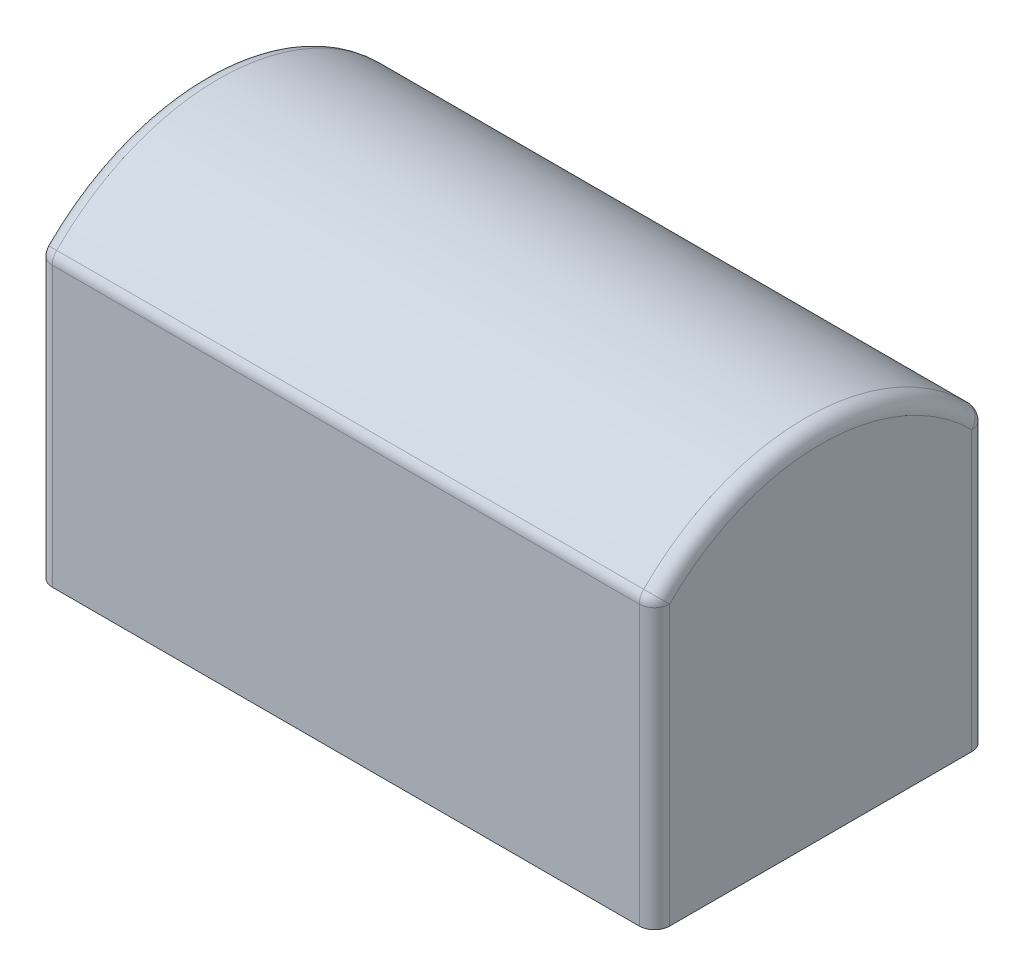
ISO-10303-21;
HEADER;
FILE_DESCRIPTION(('STEP AP214'),'2;1');
FILE_NAME('part.step','',(''),(''),'','','');
FILE_SCHEMA(('AUTOMOTIVE_DESIGN { 1 0 10303 214 1 1 1 1 }'));
ENDSEC;
DATA;
#1=APPLICATION_CONTEXT('core data for automotive mechanical design processes');
#2=APPLICATION_PROTOCOL_DEFINITION('international standard','automotive_design',2000,#1);
#3=PRODUCT_CONTEXT('',#1,'mechanical');
#4=PRODUCT('Part','Part','',(#3));
#5=PRODUCT_RELATED_PRODUCT_CATEGORY('part','',(#4));
#6=PRODUCT_DEFINITION_FORMATION('','',#4);
#7=PRODUCT_DEFINITION_CONTEXT('part definition',#1,'design');
#8=PRODUCT_DEFINITION('design','',#6,#7);
#9=PRODUCT_DEFINITION_SHAPE('','',#8);
#10=(LENGTH_UNIT() NAMED_UNIT(*) SI_UNIT(.MILLI.,.METRE.));
#11=(NAMED_UNIT(*) PLANE_ANGLE_UNIT() SI_UNIT($,.RADIAN.));
#12=(NAMED_UNIT(*) SI_UNIT($,.STERADIAN.) SOLID_ANGLE_UNIT());
#13=UNCERTAINTY_MEASURE_WITH_UNIT(LENGTH_MEASURE(1.E-05),#10,'distance_accuracy_value','');
#14=(GEOMETRIC_REPRESENTATION_CONTEXT(3) GLOBAL_UNCERTAINTY_ASSIGNED_CONTEXT((#13)) GLOBAL_UNIT_ASSIGNED_CONTEXT((#10,
#11,#12)) REPRESENTATION_CONTEXT('',''));
#15=CARTESIAN_POINT('',(0.,0.,0.));
#16=DIRECTION('',(0.,0.,1.));
#17=DIRECTION('',(1.,0.,0.));
#18=AXIS2_PLACEMENT_3D('',#15,#16,#17);
#19=CARTESIAN_POINT('',(10.31875,0.,-2.778125));
#20=DIRECTION('',(0.,0.,1.));
#21=DIRECTION('',(1.,0.,0.));
#22=AXIS2_PLACEMENT_3D('',#19,#20,#21);
#23=PLANE('',#22);
#24=DIRECTION('',(-1.,0.,0.));
#25=VECTOR('',#24,1.);
#26=CARTESIAN_POINT('',(10.31875,0.,-2.778125));
#27=LINE('',#26,#25);
#28=CARTESIAN_POINT('',(10.06475,0.,-2.778125));
#29=VERTEX_POINT('',#28);
#30=CARTESIAN_POINT('',(0.254000000000001,0.,-2.778125));
#31=VERTEX_POINT('',#30);
#32=EDGE_CURVE('E118',#29,#31,#27,.T.);
#33=ORIENTED_EDGE('',*,*,#32,.T.);
#34=DIRECTION('',(0.,1.,0.));
#35=VECTOR('',#34,1.);
#36=CARTESIAN_POINT('',(0.254000000000001,0.,-2.778125));
#37=LINE('',#36,#35);
#38=CARTESIAN_POINT('',(0.254000000000001,4.66006926887385,-2.778125));
#39=VERTEX_POINT('',#38);
#40=EDGE_CURVE('E239',#31,#39,#37,.T.);
#41=ORIENTED_EDGE('',*,*,#40,.T.);
#42=DIRECTION('',(-1.,0.,0.));
#43=VECTOR('',#42,1.);
#44=CARTESIAN_POINT('',(10.31875,4.66006926887385,-2.778125));
#45=LINE('',#44,#43);
#46=CARTESIAN_POINT('',(10.06475,4.66006926887385,-2.778125));
#47=VERTEX_POINT('',#46);
#48=EDGE_CURVE('E121',#39,#47,#45,.F.);
#49=ORIENTED_EDGE('',*,*,#48,.T.);
#50=DIRECTION('',(0.,1.,0.));
#51=VECTOR('',#50,1.);
#52=CARTESIAN_POINT('',(10.06475,0.,-2.778125));
#53=LINE('',#52,#51);
#54=EDGE_CURVE('E115',#47,#29,#53,.F.);
#55=ORIENTED_EDGE('',*,*,#54,.T.);
#56=EDGE_LOOP('',(#33,#41,#49,#55));
#57=FACE_BOUND('',#56,.T.);
#58=ADVANCED_FACE('F39',(#57),#23,.F.);
#59=CARTESIAN_POINT('',(10.31875,2.159,0.));
#60=DIRECTION('',(-1.,0.,0.));
#61=DIRECTION('',(0.,0.,1.));
#62=AXIS2_PLACEMENT_3D('',#59,#60,#61);
#63=CYLINDRICAL_SURFACE('',#62,3.80738634310008);
#64=CARTESIAN_POINT('',(10.06475,2.159,0.));
#65=DIRECTION('',(1.,0.,0.));
#66=DIRECTION('',(0.,0.,-1.));
#67=AXIS2_PLACEMENT_3D('',#64,#65,#66);
#68=CIRCLE('',#67,3.80738634310008);
#69=CARTESIAN_POINT('',(10.06475,4.83884847635505,2.70455225673355));
#70=VERTEX_POINT('',#69);
#71=CARTESIAN_POINT('',(10.06475,4.83884847635505,-2.70455225673355));
#72=VERTEX_POINT('',#71);
#73=EDGE_CURVE('E156',#70,#72,#68,.F.);
#74=ORIENTED_EDGE('',*,*,#73,.T.);
#75=DIRECTION('',(-1.,0.,0.));
#76=VECTOR('',#75,1.);
#77=CARTESIAN_POINT('',(10.31875,4.83884847635505,-2.70455225673355));
#78=LINE('',#77,#76);
#79=CARTESIAN_POINT('',(0.254000000000001,4.83884847635505,-2.70455225673355));
#80=VERTEX_POINT('',#79);
#81=EDGE_CURVE('E162',#72,#80,#78,.T.);
#82=ORIENTED_EDGE('',*,*,#81,.T.);
#83=CARTESIAN_POINT('',(0.254000000000001,2.159,0.));
#84=DIRECTION('',(1.,0.,0.));
#85=DIRECTION('',(0.,0.,-1.));
#86=AXIS2_PLACEMENT_3D('',#83,#84,#85);
#87=CIRCLE('',#86,3.80738634310008);
#88=CARTESIAN_POINT('',(0.254000000000001,4.83884847635505,2.70455225673355));
#89=VERTEX_POINT('',#88);
#90=EDGE_CURVE('E159',#80,#89,#87,.T.);
#91=ORIENTED_EDGE('',*,*,#90,.T.);
#92=DIRECTION('',(-1.,0.,0.));
#93=VECTOR('',#92,1.);
#94=CARTESIAN_POINT('',(10.31875,4.83884847635505,2.70455225673355));
#95=LINE('',#94,#93);
#96=EDGE_CURVE('E153',#89,#70,#95,.F.);
#97=ORIENTED_EDGE('',*,*,#96,.T.);
#98=EDGE_LOOP('',(#74,#82,#91,#97));
#99=FACE_BOUND('',#98,.T.);
#100=ADVANCED_FACE('F270',(#99),#63,.T.);
#101=CARTESIAN_POINT('',(10.31875,0.,2.778125));
#102=DIRECTION('',(0.,0.,-1.));
#103=DIRECTION('',(-1.,0.,0.));
#104=AXIS2_PLACEMENT_3D('',#101,#102,#103);
#105=PLANE('',#104);
#106=DIRECTION('',(-1.,0.,0.));
#107=VECTOR('',#106,1.);
#108=CARTESIAN_POINT('',(10.31875,4.66006926887385,2.778125));
#109=LINE('',#108,#107);
#110=CARTESIAN_POINT('',(10.06475,4.66006926887385,2.778125));
#111=VERTEX_POINT('',#110);
#112=CARTESIAN_POINT('',(0.254000000000001,4.66006926887385,2.778125));
#113=VERTEX_POINT('',#112);
#114=EDGE_CURVE('E169',#111,#113,#109,.T.);
#115=ORIENTED_EDGE('',*,*,#114,.T.);
#116=DIRECTION('',(0.,-1.,0.));
#117=VECTOR('',#116,1.);
#118=CARTESIAN_POINT('',(0.254000000000001,0.,2.778125));
#119=LINE('',#118,#117);
#120=CARTESIAN_POINT('',(0.254000000000001,0.,2.778125));
#121=VERTEX_POINT('',#120);
#122=EDGE_CURVE('E172',#113,#121,#119,.T.);
#123=ORIENTED_EDGE('',*,*,#122,.T.);
#124=DIRECTION('',(-1.,0.,0.));
#125=VECTOR('',#124,1.);
#126=CARTESIAN_POINT('',(10.31875,0.,2.778125));
#127=LINE('',#126,#125);
#128=CARTESIAN_POINT('',(10.06475,0.,2.778125));
#129=VERTEX_POINT('',#128);
#130=EDGE_CURVE('E127',#129,#121,#127,.T.);
#131=ORIENTED_EDGE('',*,*,#130,.F.);
#132=DIRECTION('',(0.,-1.,0.));
#133=VECTOR('',#132,1.);
#134=CARTESIAN_POINT('',(10.06475,4.7625,2.778125));
#135=LINE('',#134,#133);
#136=EDGE_CURVE('E166',#129,#111,#135,.F.);
#137=ORIENTED_EDGE('',*,*,#136,.T.);
#138=EDGE_LOOP('',(#115,#123,#131,#137));
#139=FACE_BOUND('',#138,.T.);
#140=ADVANCED_FACE('F289',(#139),#105,.F.);
#141=CARTESIAN_POINT('',(10.31875,0.,2.778125));
#142=DIRECTION('',(0.,1.,0.));
#143=DIRECTION('',(0.,0.,1.));
#144=AXIS2_PLACEMENT_3D('',#141,#142,#143);
#145=PLANE('',#144);
#146=DIRECTION('',(0.,0.,-1.));
#147=VECTOR('',#146,1.);
#148=CARTESIAN_POINT('',(0.,0.,2.778125));
#149=LINE('',#148,#147);
#150=CARTESIAN_POINT('',(0.,0.,2.524125));
#151=VERTEX_POINT('',#150);
#152=CARTESIAN_POINT('',(0.,0.,-2.524125));
#153=VERTEX_POINT('',#152);
#154=EDGE_CURVE('E224',#151,#153,#149,.T.);
#155=ORIENTED_EDGE('',*,*,#154,.T.);
#156=CARTESIAN_POINT('',(0.254000000000001,0.,-2.524125));
#157=DIRECTION('',(0.,1.,0.));
#158=DIRECTION('',(0.,0.,1.));
#159=AXIS2_PLACEMENT_3D('',#156,#157,#158);
#160=CIRCLE('',#159,0.254);
#161=EDGE_CURVE('E135',#153,#31,#160,.F.);
#162=ORIENTED_EDGE('',*,*,#161,.T.);
#163=ORIENTED_EDGE('',*,*,#32,.F.);
#164=CARTESIAN_POINT('',(10.06475,0.,-2.524125));
#165=DIRECTION('',(0.,1.,0.));
#166=DIRECTION('',(0.,0.,1.));
#167=AXIS2_PLACEMENT_3D('',#164,#165,#166);
#168=CIRCLE('',#167,0.254);
#169=CARTESIAN_POINT('',(10.31875,0.,-2.524125));
#170=VERTEX_POINT('',#169);
#171=EDGE_CURVE('E133',#29,#170,#168,.F.);
#172=ORIENTED_EDGE('',*,*,#171,.T.);
#173=DIRECTION('',(0.,0.,-1.));
#174=VECTOR('',#173,1.);
#175=CARTESIAN_POINT('',(10.31875,0.,2.778125));
#176=LINE('',#175,#174);
#177=CARTESIAN_POINT('',(10.31875,0.,2.524125));
#178=VERTEX_POINT('',#177);
#179=EDGE_CURVE('E137',#178,#170,#176,.T.);
#180=ORIENTED_EDGE('',*,*,#179,.F.);
#181=CARTESIAN_POINT('',(10.06475,0.,2.524125));
#182=DIRECTION('',(0.,1.,0.));
#183=DIRECTION('',(0.,0.,1.));
#184=AXIS2_PLACEMENT_3D('',#181,#182,#183);
#185=CIRCLE('',#184,0.254);
#186=EDGE_CURVE('E142',#178,#129,#185,.F.);
#187=ORIENTED_EDGE('',*,*,#186,.T.);
#188=ORIENTED_EDGE('',*,*,#130,.T.);
#189=CARTESIAN_POINT('',(0.254000000000001,0.,2.524125));
#190=DIRECTION('',(0.,1.,0.));
#191=DIRECTION('',(0.,0.,1.));
#192=AXIS2_PLACEMENT_3D('',#189,#190,#191);
#193=CIRCLE('',#192,0.254);
#194=EDGE_CURVE('E141',#121,#151,#193,.F.);
#195=ORIENTED_EDGE('',*,*,#194,.T.);
#196=EDGE_LOOP('',(#155,#162,#163,#172,#180,#187,#188,#195));
#197=FACE_BOUND('',#196,.T.);
#198=ADVANCED_FACE('F131',(#197),#145,.F.);
#199=CARTESIAN_POINT('',(10.31875,2.159,0.));
#200=DIRECTION('',(1.,0.,0.));
#201=DIRECTION('',(0.,0.,-1.));
#202=AXIS2_PLACEMENT_3D('',#199,#200,#201);
#203=PLANE('',#202);
#204=ORIENTED_EDGE('',*,*,#179,.T.);
#205=DIRECTION('',(0.,1.,0.));
#206=VECTOR('',#205,1.);
#207=CARTESIAN_POINT('',(10.31875,4.7625,-2.524125));
#208=LINE('',#207,#206);
#209=CARTESIAN_POINT('',(10.31875,4.66006926887386,-2.52412499999999));
#210=VERTEX_POINT('',#209);
#211=EDGE_CURVE('E11',#170,#210,#208,.T.);
#212=ORIENTED_EDGE('',*,*,#211,.T.);
#213=CARTESIAN_POINT('',(10.31875,2.159,0.));
#214=DIRECTION('',(1.,0.,0.));
#215=DIRECTION('',(0.,0.,-1.));
#216=AXIS2_PLACEMENT_3D('',#213,#214,#215);
#217=CIRCLE('',#216,3.55338634310008);
#218=CARTESIAN_POINT('',(10.31875,4.66006926887386,2.524125));
#219=VERTEX_POINT('',#218);
#220=EDGE_CURVE('E49',#210,#219,#217,.T.);
#221=ORIENTED_EDGE('',*,*,#220,.T.);
#222=DIRECTION('',(0.,-1.,0.));
#223=VECTOR('',#222,1.);
#224=CARTESIAN_POINT('',(10.31875,0.,2.524125));
#225=LINE('',#224,#223);
#226=EDGE_CURVE('E175',#219,#178,#225,.T.);
#227=ORIENTED_EDGE('',*,*,#226,.T.);
#228=EDGE_LOOP('',(#204,#212,#221,#227));
#229=FACE_BOUND('',#228,.T.);
#230=ADVANCED_FACE('F391',(#229),#203,.T.);
#231=CARTESIAN_POINT('',(0.,2.159,0.));
#232=DIRECTION('',(1.,0.,0.));
#233=DIRECTION('',(0.,0.,-1.));
#234=AXIS2_PLACEMENT_3D('',#231,#232,#233);
#235=PLANE('',#234);
#236=CARTESIAN_POINT('',(0.,2.159,0.));
#237=DIRECTION('',(1.,0.,0.));
#238=DIRECTION('',(0.,0.,-1.));
#239=AXIS2_PLACEMENT_3D('',#236,#237,#238);
#240=CIRCLE('',#239,3.55338634310008);
#241=CARTESIAN_POINT('',(0.,4.66006926887386,2.52412499999999));
#242=VERTEX_POINT('',#241);
#243=CARTESIAN_POINT('',(0.,4.66006926887386,-2.52412499999999));
#244=VERTEX_POINT('',#243);
#245=EDGE_CURVE('E242',#242,#244,#240,.F.);
#246=ORIENTED_EDGE('',*,*,#245,.T.);
#247=DIRECTION('',(0.,1.,0.));
#248=VECTOR('',#247,1.);
#249=CARTESIAN_POINT('',(0.,2.159,-2.524125));
#250=LINE('',#249,#248);
#251=EDGE_CURVE('E147',#244,#153,#250,.F.);
#252=ORIENTED_EDGE('',*,*,#251,.T.);
#253=ORIENTED_EDGE('',*,*,#154,.F.);
#254=DIRECTION('',(0.,-1.,0.));
#255=VECTOR('',#254,1.);
#256=CARTESIAN_POINT('',(0.,2.159,2.524125));
#257=LINE('',#256,#255);
#258=EDGE_CURVE('E245',#151,#242,#257,.F.);
#259=ORIENTED_EDGE('',*,*,#258,.T.);
#260=EDGE_LOOP('',(#246,#252,#253,#259));
#261=FACE_BOUND('',#260,.T.);
#262=ADVANCED_FACE('F250',(#261),#235,.F.);
#263=CARTESIAN_POINT('',(10.06475,2.159,2.524125));
#264=DIRECTION('',(0.,1.,0.));
#265=DIRECTION('',(0.,0.,1.));
#266=AXIS2_PLACEMENT_3D('',#263,#264,#265);
#267=CYLINDRICAL_SURFACE('',#266,0.254);
#268=CARTESIAN_POINT('',(10.06475,4.66006926887385,2.524125));
#269=DIRECTION('',(0.,1.,0.));
#270=DIRECTION('',(-1.,0.,0.));
#271=AXIS2_PLACEMENT_3D('',#268,#269,#270);
#272=CIRCLE('',#271,0.254);
#273=EDGE_CURVE('E43',#111,#219,#272,.T.);
#274=ORIENTED_EDGE('',*,*,#273,.F.);
#275=ORIENTED_EDGE('',*,*,#136,.F.);
#276=ORIENTED_EDGE('',*,*,#186,.F.);
#277=ORIENTED_EDGE('',*,*,#226,.F.);
#278=EDGE_LOOP('',(#274,#275,#276,#277));
#279=FACE_BOUND('',#278,.T.);
#280=ADVANCED_FACE('F41',(#279),#267,.T.);
#281=CARTESIAN_POINT('',(10.06475,4.66006926887385,2.524125));
#282=DIRECTION('',(1.,0.,0.));
#283=DIRECTION('',(0.,1.,0.));
#284=AXIS2_PLACEMENT_3D('',#281,#282,#283);
#285=SPHERICAL_SURFACE('',#284,0.254);
#286=CARTESIAN_POINT('',(10.06475,4.66006926887385,2.524125));
#287=DIRECTION('',(1.,0.,0.));
#288=DIRECTION('',(0.,0.,-1.));
#289=AXIS2_PLACEMENT_3D('',#286,#287,#288);
#290=CIRCLE('',#289,0.254);
#291=EDGE_CURVE('E213',#111,#70,#290,.F.);
#292=ORIENTED_EDGE('',*,*,#291,.F.);
#293=ORIENTED_EDGE('',*,*,#273,.T.);
#294=CARTESIAN_POINT('',(10.06475,4.66006926887386,2.52412499999999));
#295=DIRECTION('',(0.,-0.710343530447067,0.703855147563756));
#296=DIRECTION('',(0.,-0.703855147563756,-0.710343530447067));
#297=AXIS2_PLACEMENT_3D('',#294,#295,#296);
#298=CIRCLE('',#297,0.254);
#299=EDGE_CURVE('E216',#70,#219,#298,.F.);
#300=ORIENTED_EDGE('',*,*,#299,.F.);
#301=EDGE_LOOP('',(#292,#293,#300));
#302=FACE_BOUND('',#301,.T.);
#303=ADVANCED_FACE('F276',(#302),#285,.T.);
#304=CARTESIAN_POINT('',(10.06475,2.159,-2.524125));
#305=DIRECTION('',(0.,-1.,0.));
#306=DIRECTION('',(0.,0.,-1.));
#307=AXIS2_PLACEMENT_3D('',#304,#305,#306);
#308=CYLINDRICAL_SURFACE('',#307,0.254);
#309=ORIENTED_EDGE('',*,*,#171,.F.);
#310=ORIENTED_EDGE('',*,*,#54,.F.);
#311=CARTESIAN_POINT('',(10.06475,4.66006926887386,-2.524125));
#312=DIRECTION('',(0.,1.,0.));
#313=DIRECTION('',(0.,0.,1.));
#314=AXIS2_PLACEMENT_3D('',#311,#312,#313);
#315=CIRCLE('',#314,0.254);
#316=EDGE_CURVE('E210',#210,#47,#315,.T.);
#317=ORIENTED_EDGE('',*,*,#316,.F.);
#318=ORIENTED_EDGE('',*,*,#211,.F.);
#319=EDGE_LOOP('',(#309,#310,#317,#318));
#320=FACE_BOUND('',#319,.T.);
#321=ADVANCED_FACE('F139',(#320),#308,.T.);
#322=CARTESIAN_POINT('',(10.06475,2.159,0.));
#323=DIRECTION('',(1.,0.,0.));
#324=DIRECTION('',(0.,0.,-1.));
#325=AXIS2_PLACEMENT_3D('',#322,#323,#324);
#326=TOROIDAL_SURFACE('',#325,3.55338634310008,0.254);
#327=ORIENTED_EDGE('',*,*,#299,.T.);
#328=ORIENTED_EDGE('',*,*,#220,.F.);
#329=CARTESIAN_POINT('',(10.06475,4.66006926887385,-2.524125));
#330=DIRECTION('',(0.,-0.710343530447037,-0.703855147563786));
#331=DIRECTION('',(0.,0.703855147563786,-0.710343530447037));
#332=AXIS2_PLACEMENT_3D('',#329,#330,#331);
#333=CIRCLE('',#332,0.254);
#334=EDGE_CURVE('E206',#72,#210,#333,.T.);
#335=ORIENTED_EDGE('',*,*,#334,.F.);
#336=ORIENTED_EDGE('',*,*,#73,.F.);
#337=EDGE_LOOP('',(#327,#328,#335,#336));
#338=FACE_BOUND('',#337,.T.);
#339=ADVANCED_FACE('F268',(#338),#326,.T.);
#340=CARTESIAN_POINT('',(10.31875,4.66006926887385,2.524125));
#341=DIRECTION('',(-1.,0.,0.));
#342=DIRECTION('',(0.,0.,1.));
#343=AXIS2_PLACEMENT_3D('',#340,#341,#342);
#344=CYLINDRICAL_SURFACE('',#343,0.254);
#345=ORIENTED_EDGE('',*,*,#291,.T.);
#346=ORIENTED_EDGE('',*,*,#96,.F.);
#347=CARTESIAN_POINT('',(0.254000000000001,4.66006926887385,2.524125));
#348=DIRECTION('',(-1.,0.,0.));
#349=DIRECTION('',(0.,0.,1.));
#350=AXIS2_PLACEMENT_3D('',#347,#348,#349);
#351=CIRCLE('',#350,0.254);
#352=EDGE_CURVE('E202',#113,#89,#351,.T.);
#353=ORIENTED_EDGE('',*,*,#352,.F.);
#354=ORIENTED_EDGE('',*,*,#114,.F.);
#355=EDGE_LOOP('',(#345,#346,#353,#354));
#356=FACE_BOUND('',#355,.T.);
#357=ADVANCED_FACE('F275',(#356),#344,.T.);
#358=CARTESIAN_POINT('',(0.254000000000001,0.,2.524125));
#359=DIRECTION('',(0.,-1.,0.));
#360=DIRECTION('',(0.,0.,-1.));
#361=AXIS2_PLACEMENT_3D('',#358,#359,#360);
#362=CYLINDRICAL_SURFACE('',#361,0.254);
#363=ORIENTED_EDGE('',*,*,#194,.F.);
#364=ORIENTED_EDGE('',*,*,#122,.F.);
#365=CARTESIAN_POINT('',(0.254,4.66006926887387,2.524125));
#366=DIRECTION('',(0.,1.,0.));
#367=DIRECTION('',(0.,0.,1.));
#368=AXIS2_PLACEMENT_3D('',#365,#366,#367);
#369=CIRCLE('',#368,0.254);
#370=EDGE_CURVE('E198',#242,#113,#369,.T.);
#371=ORIENTED_EDGE('',*,*,#370,.F.);
#372=ORIENTED_EDGE('',*,*,#258,.F.);
#373=EDGE_LOOP('',(#363,#364,#371,#372));
#374=FACE_BOUND('',#373,.T.);
#375=ADVANCED_FACE('F309',(#374),#362,.T.);
#376=CARTESIAN_POINT('',(10.06475,4.66006926887385,-2.524125));
#377=DIRECTION('',(1.,0.,0.));
#378=DIRECTION('',(0.,1.,0.));
#379=AXIS2_PLACEMENT_3D('',#376,#377,#378);
#380=SPHERICAL_SURFACE('',#379,0.254);
#381=ORIENTED_EDGE('',*,*,#334,.T.);
#382=ORIENTED_EDGE('',*,*,#316,.T.);
#383=CARTESIAN_POINT('',(10.06475,4.66006926887385,-2.524125));
#384=DIRECTION('',(1.,0.,0.));
#385=DIRECTION('',(0.,0.,-1.));
#386=AXIS2_PLACEMENT_3D('',#383,#384,#385);
#387=CIRCLE('',#386,0.254);
#388=EDGE_CURVE('E194',#72,#47,#387,.F.);
#389=ORIENTED_EDGE('',*,*,#388,.F.);
#390=EDGE_LOOP('',(#381,#382,#389));
#391=FACE_BOUND('',#390,.T.);
#392=ADVANCED_FACE('F266',(#391),#380,.T.);
#393=CARTESIAN_POINT('',(0.254,4.66006926887385,2.524125));
#394=DIRECTION('',(-1.,0.,0.));
#395=DIRECTION('',(0.,-1.,0.));
#396=AXIS2_PLACEMENT_3D('',#393,#394,#395);
#397=SPHERICAL_SURFACE('',#396,0.254);
#398=ORIENTED_EDGE('',*,*,#370,.T.);
#399=ORIENTED_EDGE('',*,*,#352,.T.);
#400=CARTESIAN_POINT('',(0.254000000000001,4.66006926887385,2.524125));
#401=DIRECTION('',(0.,-0.710343530447037,0.703855147563786));
#402=DIRECTION('',(0.,-0.703855147563786,-0.710343530447037));
#403=AXIS2_PLACEMENT_3D('',#400,#401,#402);
#404=CIRCLE('',#403,0.254);
#405=EDGE_CURVE('E190',#242,#89,#404,.F.);
#406=ORIENTED_EDGE('',*,*,#405,.F.);
#407=EDGE_LOOP('',(#398,#399,#406));
#408=FACE_BOUND('',#407,.T.);
#409=ADVANCED_FACE('F303',(#408),#397,.T.);
#410=CARTESIAN_POINT('',(10.31875,4.66006926887385,-2.524125));
#411=DIRECTION('',(-1.,0.,0.));
#412=DIRECTION('',(0.,0.,1.));
#413=AXIS2_PLACEMENT_3D('',#410,#411,#412);
#414=CYLINDRICAL_SURFACE('',#413,0.254);
#415=ORIENTED_EDGE('',*,*,#388,.T.);
#416=ORIENTED_EDGE('',*,*,#48,.F.);
#417=CARTESIAN_POINT('',(0.254000000000001,4.66006926887385,-2.524125));
#418=DIRECTION('',(-1.,0.,0.));
#419=DIRECTION('',(0.,0.,1.));
#420=AXIS2_PLACEMENT_3D('',#417,#418,#419);
#421=CIRCLE('',#420,0.254);
#422=EDGE_CURVE('E186',#80,#39,#421,.T.);
#423=ORIENTED_EDGE('',*,*,#422,.F.);
#424=ORIENTED_EDGE('',*,*,#81,.F.);
#425=EDGE_LOOP('',(#415,#416,#423,#424));
#426=FACE_BOUND('',#425,.T.);
#427=ADVANCED_FACE('F263',(#426),#414,.T.);
#428=CARTESIAN_POINT('',(0.254000000000001,2.159,0.));
#429=DIRECTION('',(1.,0.,0.));
#430=DIRECTION('',(0.,0.,-1.));
#431=AXIS2_PLACEMENT_3D('',#428,#429,#430);
#432=TOROIDAL_SURFACE('',#431,3.55338634310008,0.254);
#433=ORIENTED_EDGE('',*,*,#405,.T.);
#434=ORIENTED_EDGE('',*,*,#90,.F.);
#435=CARTESIAN_POINT('',(0.254,4.66006926887386,-2.52412499999999));
#436=DIRECTION('',(0.,-0.71034353044707,-0.703855147563753));
#437=DIRECTION('',(0.,0.703855147563753,-0.71034353044707));
#438=AXIS2_PLACEMENT_3D('',#435,#436,#437);
#439=CIRCLE('',#438,0.254);
#440=EDGE_CURVE('E183',#244,#80,#439,.T.);
#441=ORIENTED_EDGE('',*,*,#440,.F.);
#442=ORIENTED_EDGE('',*,*,#245,.F.);
#443=EDGE_LOOP('',(#433,#434,#441,#442));
#444=FACE_BOUND('',#443,.T.);
#445=ADVANCED_FACE('F297',(#444),#432,.T.);
#446=CARTESIAN_POINT('',(0.254,4.66006926887385,-2.524125));
#447=DIRECTION('',(-1.,0.,0.));
#448=DIRECTION('',(0.,-1.,0.));
#449=AXIS2_PLACEMENT_3D('',#446,#447,#448);
#450=SPHERICAL_SURFACE('',#449,0.254);
#451=ORIENTED_EDGE('',*,*,#440,.T.);
#452=ORIENTED_EDGE('',*,*,#422,.T.);
#453=CARTESIAN_POINT('',(0.254000000000001,4.66006926887385,-2.524125));
#454=DIRECTION('',(0.,1.,0.));
#455=DIRECTION('',(-1.,0.,0.));
#456=AXIS2_PLACEMENT_3D('',#453,#454,#455);
#457=CIRCLE('',#456,0.254);
#458=EDGE_CURVE('E180',#244,#39,#457,.F.);
#459=ORIENTED_EDGE('',*,*,#458,.F.);
#460=EDGE_LOOP('',(#451,#452,#459));
#461=FACE_BOUND('',#460,.T.);
#462=ADVANCED_FACE('F258',(#461),#450,.T.);
#463=CARTESIAN_POINT('',(0.254000000000001,0.,-2.524125));
#464=DIRECTION('',(0.,1.,0.));
#465=DIRECTION('',(0.,0.,1.));
#466=AXIS2_PLACEMENT_3D('',#463,#464,#465);
#467=CYLINDRICAL_SURFACE('',#466,0.254);
#468=ORIENTED_EDGE('',*,*,#161,.F.);
#469=ORIENTED_EDGE('',*,*,#251,.F.);
#470=ORIENTED_EDGE('',*,*,#458,.T.);
#471=ORIENTED_EDGE('',*,*,#40,.F.);
#472=EDGE_LOOP('',(#468,#469,#470,#471));
#473=FACE_BOUND('',#472,.T.);
#474=ADVANCED_FACE('F256',(#473),#467,.T.);
#475=CLOSED_SHELL('',(#58,#100,#140,#198,#230,#262,#280,#303,#321,#339,#357,#375,#392,#409,#427,
#445,#462,#474));
#476=MANIFOLD_SOLID_BREP('B2',#475);
#477=ADVANCED_BREP_SHAPE_REPRESENTATION('',(#18,#476),#14);
#478=SHAPE_DEFINITION_REPRESENTATION(#9,#477);
ENDSEC;
END-ISO-10303-21;
